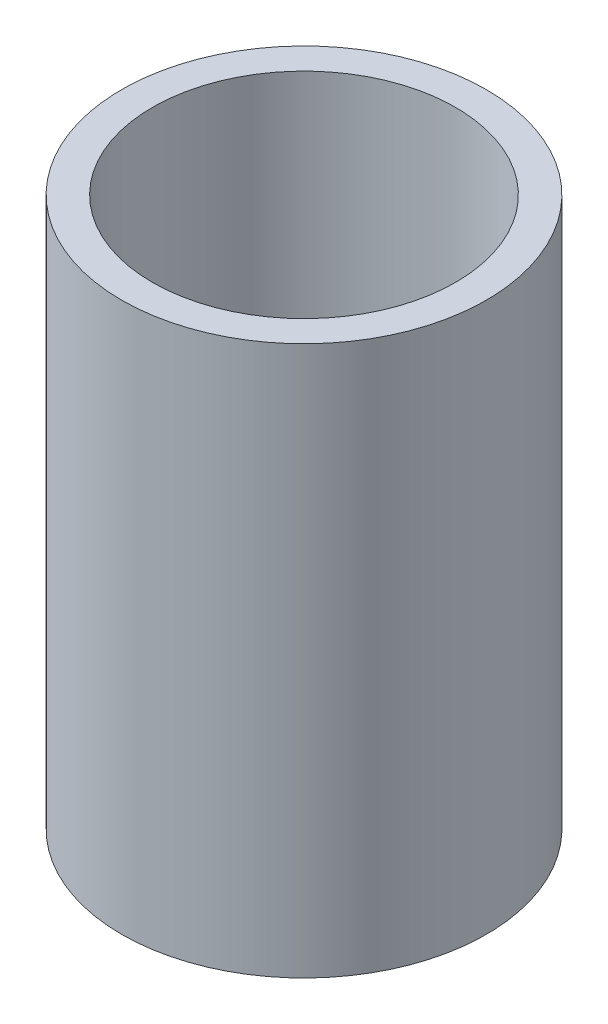
ISO-10303-21;
HEADER;
FILE_DESCRIPTION(('STEP AP214'),'2;1');
FILE_NAME('part.step','',(''),(''),'','','');
FILE_SCHEMA(('AUTOMOTIVE_DESIGN { 1 0 10303 214 1 1 1 1 }'));
ENDSEC;
DATA;
#1=APPLICATION_CONTEXT('core data for automotive mechanical design processes');
#2=APPLICATION_PROTOCOL_DEFINITION('international standard','automotive_design',2000,#1);
#3=PRODUCT_CONTEXT('',#1,'mechanical');
#4=PRODUCT('Part','Part','',(#3));
#5=PRODUCT_RELATED_PRODUCT_CATEGORY('part','',(#4));
#6=PRODUCT_DEFINITION_FORMATION('','',#4);
#7=PRODUCT_DEFINITION_CONTEXT('part definition',#1,'design');
#8=PRODUCT_DEFINITION('design','',#6,#7);
#9=PRODUCT_DEFINITION_SHAPE('','',#8);
#10=(LENGTH_UNIT() NAMED_UNIT(*) SI_UNIT(.MILLI.,.METRE.));
#11=(NAMED_UNIT(*) PLANE_ANGLE_UNIT() SI_UNIT($,.RADIAN.));
#12=(NAMED_UNIT(*) SI_UNIT($,.STERADIAN.) SOLID_ANGLE_UNIT());
#13=UNCERTAINTY_MEASURE_WITH_UNIT(LENGTH_MEASURE(1.E-05),#10,'distance_accuracy_value','');
#14=(GEOMETRIC_REPRESENTATION_CONTEXT(3) GLOBAL_UNCERTAINTY_ASSIGNED_CONTEXT((#13)) GLOBAL_UNIT_ASSIGNED_CONTEXT((#10,
#11,#12)) REPRESENTATION_CONTEXT('',''));
#15=CARTESIAN_POINT('',(0.,0.,0.));
#16=DIRECTION('',(0.,0.,1.));
#17=DIRECTION('',(1.,0.,0.));
#18=AXIS2_PLACEMENT_3D('',#15,#16,#17);
#19=CARTESIAN_POINT('',(0.,63.5,0.));
#20=DIRECTION('',(0.,1.,0.));
#21=DIRECTION('',(0.,0.,1.));
#22=AXIS2_PLACEMENT_3D('',#19,#20,#21);
#23=PLANE('',#22);
#24=CARTESIAN_POINT('',(0.,63.5,0.));
#25=DIRECTION('',(0.,1.,0.));
#26=DIRECTION('',(0.,0.,1.));
#27=AXIS2_PLACEMENT_3D('',#24,#25,#26);
#28=CIRCLE('',#27,21.082);
#29=CARTESIAN_POINT('',(0.,63.5,21.082));
#30=VERTEX_POINT('',#29);
#31=EDGE_CURVE('E10',#30,#30,#28,.T.);
#32=ORIENTED_EDGE('',*,*,#31,.T.);
#33=EDGE_LOOP('',(#32));
#34=FACE_BOUND('',#33,.T.);
#35=CARTESIAN_POINT('',(0.,63.5,0.));
#36=DIRECTION('',(0.,1.,0.));
#37=DIRECTION('',(0.,0.,1.));
#38=AXIS2_PLACEMENT_3D('',#35,#36,#37);
#39=CIRCLE('',#38,17.526);
#40=CARTESIAN_POINT('',(0.,63.5,17.526));
#41=VERTEX_POINT('',#40);
#42=EDGE_CURVE('E43',#41,#41,#39,.T.);
#43=ORIENTED_EDGE('',*,*,#42,.F.);
#44=EDGE_LOOP('',(#43));
#45=FACE_BOUND('',#44,.T.);
#46=ADVANCED_FACE('F32',(#34,#45),#23,.T.);
#47=CARTESIAN_POINT('',(0.,0.,0.));
#48=DIRECTION('',(0.,1.,0.));
#49=DIRECTION('',(0.,0.,1.));
#50=AXIS2_PLACEMENT_3D('',#47,#48,#49);
#51=PLANE('',#50);
#52=CARTESIAN_POINT('',(0.,0.,0.));
#53=DIRECTION('',(0.,1.,0.));
#54=DIRECTION('',(0.,0.,1.));
#55=AXIS2_PLACEMENT_3D('',#52,#53,#54);
#56=CIRCLE('',#55,21.082);
#57=CARTESIAN_POINT('',(0.,0.,21.082));
#58=VERTEX_POINT('',#57);
#59=EDGE_CURVE('E36',#58,#58,#56,.T.);
#60=ORIENTED_EDGE('',*,*,#59,.F.);
#61=EDGE_LOOP('',(#60));
#62=FACE_BOUND('',#61,.T.);
#63=CARTESIAN_POINT('',(0.,0.,0.));
#64=DIRECTION('',(0.,1.,0.));
#65=DIRECTION('',(0.,0.,1.));
#66=AXIS2_PLACEMENT_3D('',#63,#64,#65);
#67=CIRCLE('',#66,17.526);
#68=CARTESIAN_POINT('',(0.,0.,17.526));
#69=VERTEX_POINT('',#68);
#70=EDGE_CURVE('E45',#69,#69,#67,.T.);
#71=ORIENTED_EDGE('',*,*,#70,.T.);
#72=EDGE_LOOP('',(#71));
#73=FACE_BOUND('',#72,.T.);
#74=ADVANCED_FACE('F55',(#62,#73),#51,.F.);
#75=CARTESIAN_POINT('',(0.,63.5,0.));
#76=DIRECTION('',(0.,-1.,0.));
#77=DIRECTION('',(0.,0.,-1.));
#78=AXIS2_PLACEMENT_3D('',#75,#76,#77);
#79=CYLINDRICAL_SURFACE('',#78,21.082);
#80=ORIENTED_EDGE('',*,*,#31,.F.);
#81=EDGE_LOOP('',(#80));
#82=FACE_BOUND('',#81,.T.);
#83=ORIENTED_EDGE('',*,*,#59,.T.);
#84=EDGE_LOOP('',(#83));
#85=FACE_BOUND('',#84,.T.);
#86=ADVANCED_FACE('F34',(#82,#85),#79,.T.);
#87=CARTESIAN_POINT('',(0.,63.5,0.));
#88=DIRECTION('',(0.,-1.,0.));
#89=DIRECTION('',(0.,0.,-1.));
#90=AXIS2_PLACEMENT_3D('',#87,#88,#89);
#91=CYLINDRICAL_SURFACE('',#90,17.526);
#92=ORIENTED_EDGE('',*,*,#42,.T.);
#93=EDGE_LOOP('',(#92));
#94=FACE_BOUND('',#93,.T.);
#95=ORIENTED_EDGE('',*,*,#70,.F.);
#96=EDGE_LOOP('',(#95));
#97=FACE_BOUND('',#96,.T.);
#98=ADVANCED_FACE('F51',(#94,#97),#91,.F.);
#99=CLOSED_SHELL('',(#46,#74,#86,#98));
#100=MANIFOLD_SOLID_BREP('B2',#99);
#101=ADVANCED_BREP_SHAPE_REPRESENTATION('',(#18,#100),#14);
#102=SHAPE_DEFINITION_REPRESENTATION(#9,#101);
ENDSEC;
END-ISO-10303-21;
